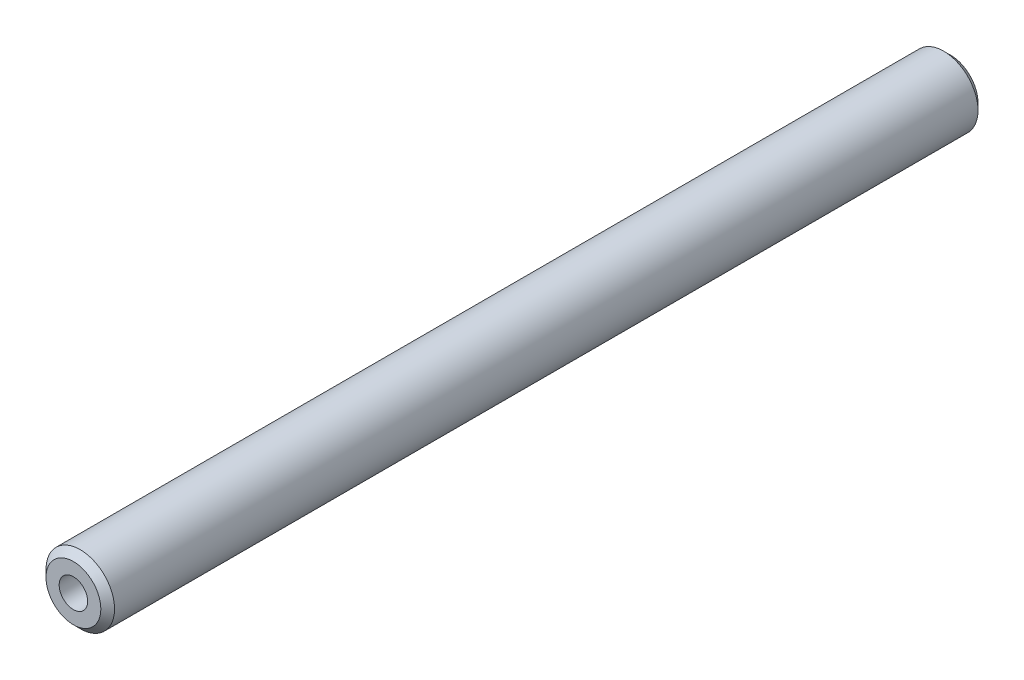
ISO-10303-21;
HEADER;
FILE_DESCRIPTION(('STEP AP214'),'2;1');
FILE_NAME('part.step','',(''),(''),'','','');
FILE_SCHEMA(('AUTOMOTIVE_DESIGN { 1 0 10303 214 1 1 1 1 }'));
ENDSEC;
DATA;
#1=APPLICATION_CONTEXT('core data for automotive mechanical design processes');
#2=APPLICATION_PROTOCOL_DEFINITION('international standard','automotive_design',2000,#1);
#3=PRODUCT_CONTEXT('',#1,'mechanical');
#4=PRODUCT('Part','Part','',(#3));
#5=PRODUCT_RELATED_PRODUCT_CATEGORY('part','',(#4));
#6=PRODUCT_DEFINITION_FORMATION('','',#4);
#7=PRODUCT_DEFINITION_CONTEXT('part definition',#1,'design');
#8=PRODUCT_DEFINITION('design','',#6,#7);
#9=PRODUCT_DEFINITION_SHAPE('','',#8);
#10=(LENGTH_UNIT() NAMED_UNIT(*) SI_UNIT(.MILLI.,.METRE.));
#11=(NAMED_UNIT(*) PLANE_ANGLE_UNIT() SI_UNIT($,.RADIAN.));
#12=(NAMED_UNIT(*) SI_UNIT($,.STERADIAN.) SOLID_ANGLE_UNIT());
#13=UNCERTAINTY_MEASURE_WITH_UNIT(LENGTH_MEASURE(1.E-05),#10,'distance_accuracy_value','');
#14=(GEOMETRIC_REPRESENTATION_CONTEXT(3) GLOBAL_UNCERTAINTY_ASSIGNED_CONTEXT((#13)) GLOBAL_UNIT_ASSIGNED_CONTEXT((#10,
#11,#12)) REPRESENTATION_CONTEXT('',''));
#15=CARTESIAN_POINT('',(0.,0.,0.));
#16=DIRECTION('',(0.,0.,1.));
#17=DIRECTION('',(1.,0.,0.));
#18=AXIS2_PLACEMENT_3D('',#15,#16,#17);
#19=CARTESIAN_POINT('',(0.,0.,50.8));
#20=DIRECTION('',(0.,0.,-1.));
#21=DIRECTION('',(-1.,0.,0.));
#22=AXIS2_PLACEMENT_3D('',#19,#20,#21);
#23=CYLINDRICAL_SURFACE('',#22,3.96875);
#24=CARTESIAN_POINT('',(0.,0.,-50.00625));
#25=DIRECTION('',(0.,0.,1.));
#26=DIRECTION('',(1.,0.,0.));
#27=AXIS2_PLACEMENT_3D('',#24,#25,#26);
#28=CIRCLE('',#27,3.96875);
#29=CARTESIAN_POINT('',(3.96875,0.,-50.00625));
#30=VERTEX_POINT('',#29);
#31=EDGE_CURVE('E74',#30,#30,#28,.T.);
#32=ORIENTED_EDGE('',*,*,#31,.T.);
#33=EDGE_LOOP('',(#32));
#34=FACE_BOUND('',#33,.T.);
#35=CARTESIAN_POINT('',(0.,0.,50.00625));
#36=DIRECTION('',(0.,0.,1.));
#37=DIRECTION('',(1.,0.,0.));
#38=AXIS2_PLACEMENT_3D('',#35,#36,#37);
#39=CIRCLE('',#38,3.96875);
#40=CARTESIAN_POINT('',(3.96875,0.,50.00625));
#41=VERTEX_POINT('',#40);
#42=EDGE_CURVE('E71',#41,#41,#39,.F.);
#43=ORIENTED_EDGE('',*,*,#42,.T.);
#44=EDGE_LOOP('',(#43));
#45=FACE_BOUND('',#44,.T.);
#46=ADVANCED_FACE('F36',(#34,#45),#23,.T.);
#47=CARTESIAN_POINT('',(0.,0.,50.8));
#48=DIRECTION('',(0.,0.,1.));
#49=DIRECTION('',(1.,0.,0.));
#50=AXIS2_PLACEMENT_3D('',#47,#48,#49);
#51=PLANE('',#50);
#52=CARTESIAN_POINT('',(0.,0.,50.8));
#53=DIRECTION('',(0.,0.,1.));
#54=DIRECTION('',(1.,0.,0.));
#55=AXIS2_PLACEMENT_3D('',#52,#53,#54);
#56=CIRCLE('',#55,1.64999999999999);
#57=CARTESIAN_POINT('',(1.64999999999999,0.,50.8));
#58=VERTEX_POINT('',#57);
#59=EDGE_CURVE('E61',#58,#58,#56,.T.);
#60=ORIENTED_EDGE('',*,*,#59,.F.);
#61=EDGE_LOOP('',(#60));
#62=FACE_BOUND('',#61,.T.);
#63=CARTESIAN_POINT('',(0.,0.,50.8));
#64=DIRECTION('',(0.,0.,1.));
#65=DIRECTION('',(1.,0.,0.));
#66=AXIS2_PLACEMENT_3D('',#63,#64,#65);
#67=CIRCLE('',#66,3.17499999999998);
#68=CARTESIAN_POINT('',(3.17499999999998,0.,50.8));
#69=VERTEX_POINT('',#68);
#70=EDGE_CURVE('E11',#69,#69,#67,.T.);
#71=ORIENTED_EDGE('',*,*,#70,.T.);
#72=EDGE_LOOP('',(#71));
#73=FACE_BOUND('',#72,.T.);
#74=ADVANCED_FACE('F88',(#62,#73),#51,.T.);
#75=CARTESIAN_POINT('',(0.,0.,-50.8));
#76=DIRECTION('',(0.,0.,1.));
#77=DIRECTION('',(1.,0.,0.));
#78=AXIS2_PLACEMENT_3D('',#75,#76,#77);
#79=PLANE('',#78);
#80=CARTESIAN_POINT('',(0.,0.,-50.8));
#81=DIRECTION('',(0.,0.,-1.));
#82=DIRECTION('',(-1.,0.,0.));
#83=AXIS2_PLACEMENT_3D('',#80,#81,#82);
#84=CIRCLE('',#83,1.64999999999999);
#85=CARTESIAN_POINT('',(-1.64999999999999,0.,-50.8));
#86=VERTEX_POINT('',#85);
#87=EDGE_CURVE('E60',#86,#86,#84,.T.);
#88=ORIENTED_EDGE('',*,*,#87,.F.);
#89=EDGE_LOOP('',(#88));
#90=FACE_BOUND('',#89,.T.);
#91=CARTESIAN_POINT('',(0.,0.,-50.8));
#92=DIRECTION('',(0.,0.,1.));
#93=DIRECTION('',(1.,0.,0.));
#94=AXIS2_PLACEMENT_3D('',#91,#92,#93);
#95=CIRCLE('',#94,3.17500000000001);
#96=CARTESIAN_POINT('',(3.17500000000001,0.,-50.8));
#97=VERTEX_POINT('',#96);
#98=EDGE_CURVE('E44',#97,#97,#95,.F.);
#99=ORIENTED_EDGE('',*,*,#98,.T.);
#100=EDGE_LOOP('',(#99));
#101=FACE_BOUND('',#100,.T.);
#102=ADVANCED_FACE('F79',(#90,#101),#79,.F.);
#103=CARTESIAN_POINT('',(0.,0.,-50.00625));
#104=DIRECTION('',(0.,0.,1.));
#105=DIRECTION('',(1.,0.,0.));
#106=AXIS2_PLACEMENT_3D('',#103,#104,#105);
#107=CONICAL_SURFACE('',#106,3.96875,0.785398163397435);
#108=ORIENTED_EDGE('',*,*,#98,.F.);
#109=EDGE_LOOP('',(#108));
#110=FACE_BOUND('',#109,.T.);
#111=ORIENTED_EDGE('',*,*,#31,.F.);
#112=EDGE_LOOP('',(#111));
#113=FACE_BOUND('',#112,.T.);
#114=ADVANCED_FACE('F81',(#110,#113),#107,.T.);
#115=CARTESIAN_POINT('',(0.,0.,50.8));
#116=DIRECTION('',(0.,0.,-1.));
#117=DIRECTION('',(-1.,0.,0.));
#118=AXIS2_PLACEMENT_3D('',#115,#116,#117);
#119=CONICAL_SURFACE('',#118,3.17499999999998,0.78539816339744);
#120=ORIENTED_EDGE('',*,*,#42,.F.);
#121=EDGE_LOOP('',(#120));
#122=FACE_BOUND('',#121,.T.);
#123=ORIENTED_EDGE('',*,*,#70,.F.);
#124=EDGE_LOOP('',(#123));
#125=FACE_BOUND('',#124,.T.);
#126=ADVANCED_FACE('F38',(#122,#125),#119,.T.);
#127=CARTESIAN_POINT('',(0.,0.,-35.8));
#128=DIRECTION('',(0.,0.,-1.));
#129=DIRECTION('',(-1.,0.,0.));
#130=AXIS2_PLACEMENT_3D('',#127,#128,#129);
#131=CONICAL_SURFACE('',#130,1.65,1.02974425867665);
#132=CARTESIAN_POINT('',(0.,0.,-34.8085799786045));
#133=VERTEX_POINT('',#132);
#134=VERTEX_LOOP('',#133);
#135=FACE_BOUND('',#134,.T.);
#136=CARTESIAN_POINT('',(0.,0.,-35.8));
#137=DIRECTION('',(0.,0.,-1.));
#138=DIRECTION('',(-1.,0.,0.));
#139=AXIS2_PLACEMENT_3D('',#136,#137,#138);
#140=CIRCLE('',#139,1.65);
#141=CARTESIAN_POINT('',(-1.65,0.,-35.8));
#142=VERTEX_POINT('',#141);
#143=EDGE_CURVE('E64',#142,#142,#140,.T.);
#144=ORIENTED_EDGE('',*,*,#143,.T.);
#145=EDGE_LOOP('',(#144));
#146=FACE_BOUND('',#145,.T.);
#147=ADVANCED_FACE('F94',(#135,#146),#131,.F.);
#148=CARTESIAN_POINT('',(0.,0.,-50.8));
#149=DIRECTION('',(0.,0.,-1.));
#150=DIRECTION('',(-1.,0.,0.));
#151=AXIS2_PLACEMENT_3D('',#148,#149,#150);
#152=CYLINDRICAL_SURFACE('',#151,1.64999999999999);
#153=ORIENTED_EDGE('',*,*,#143,.F.);
#154=EDGE_LOOP('',(#153));
#155=FACE_BOUND('',#154,.T.);
#156=ORIENTED_EDGE('',*,*,#87,.T.);
#157=EDGE_LOOP('',(#156));
#158=FACE_BOUND('',#157,.T.);
#159=ADVANCED_FACE('F54',(#155,#158),#152,.F.);
#160=CARTESIAN_POINT('',(0.,0.,35.8));
#161=DIRECTION('',(0.,0.,1.));
#162=DIRECTION('',(1.,0.,0.));
#163=AXIS2_PLACEMENT_3D('',#160,#161,#162);
#164=CONICAL_SURFACE('',#163,1.65,1.02974425867665);
#165=CARTESIAN_POINT('',(0.,0.,34.8085799786045));
#166=VERTEX_POINT('',#165);
#167=VERTEX_LOOP('',#166);
#168=FACE_BOUND('',#167,.T.);
#169=CARTESIAN_POINT('',(0.,0.,35.8));
#170=DIRECTION('',(0.,0.,1.));
#171=DIRECTION('',(1.,0.,0.));
#172=AXIS2_PLACEMENT_3D('',#169,#170,#171);
#173=CIRCLE('',#172,1.65);
#174=CARTESIAN_POINT('',(1.65,0.,35.8));
#175=VERTEX_POINT('',#174);
#176=EDGE_CURVE('E58',#175,#175,#173,.T.);
#177=ORIENTED_EDGE('',*,*,#176,.T.);
#178=EDGE_LOOP('',(#177));
#179=FACE_BOUND('',#178,.T.);
#180=ADVANCED_FACE('F50',(#168,#179),#164,.F.);
#181=CARTESIAN_POINT('',(0.,0.,50.8));
#182=DIRECTION('',(0.,0.,1.));
#183=DIRECTION('',(1.,0.,0.));
#184=AXIS2_PLACEMENT_3D('',#181,#182,#183);
#185=CYLINDRICAL_SURFACE('',#184,1.64999999999999);
#186=ORIENTED_EDGE('',*,*,#176,.F.);
#187=EDGE_LOOP('',(#186));
#188=FACE_BOUND('',#187,.T.);
#189=ORIENTED_EDGE('',*,*,#59,.T.);
#190=EDGE_LOOP('',(#189));
#191=FACE_BOUND('',#190,.T.);
#192=ADVANCED_FACE('F53',(#188,#191),#185,.F.);
#193=CLOSED_SHELL('',(#46,#74,#102,#114,#126,#147,#159,#180,#192));
#194=MANIFOLD_SOLID_BREP('B2',#193);
#195=ADVANCED_BREP_SHAPE_REPRESENTATION('',(#18,#194),#14);
#196=SHAPE_DEFINITION_REPRESENTATION(#9,#195);
ENDSEC;
END-ISO-10303-21;
